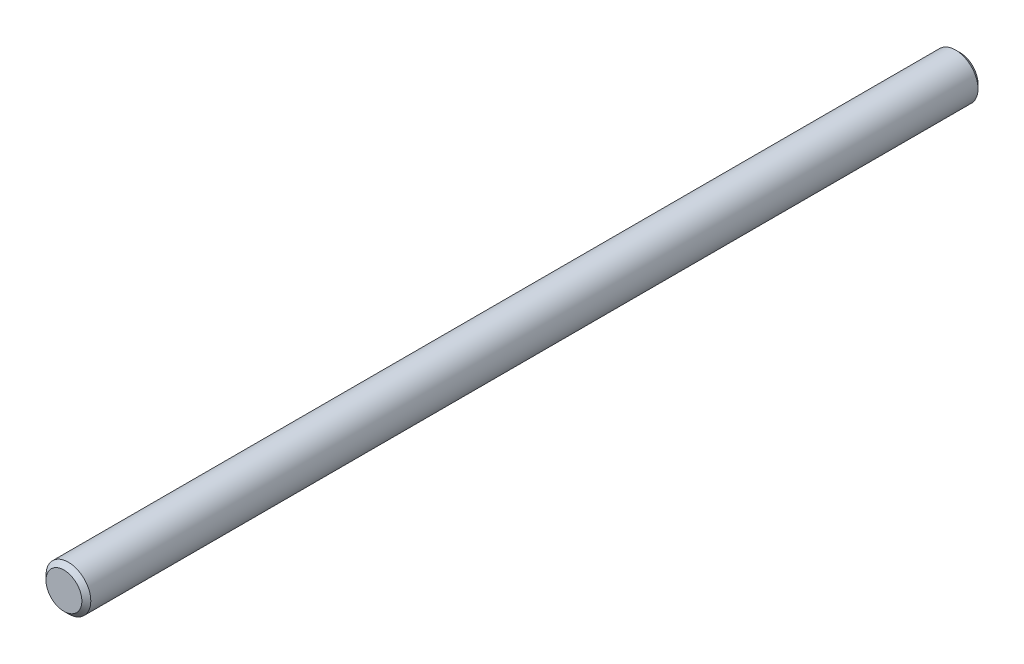
ISO-10303-21;
HEADER;
FILE_DESCRIPTION(('STEP AP214'),'2;1');
FILE_NAME('part.step','',(''),(''),'','','');
FILE_SCHEMA(('AUTOMOTIVE_DESIGN { 1 0 10303 214 1 1 1 1 }'));
ENDSEC;
DATA;
#1=APPLICATION_CONTEXT('core data for automotive mechanical design processes');
#2=APPLICATION_PROTOCOL_DEFINITION('international standard','automotive_design',2000,#1);
#3=PRODUCT_CONTEXT('',#1,'mechanical');
#4=PRODUCT('Part','Part','',(#3));
#5=PRODUCT_RELATED_PRODUCT_CATEGORY('part','',(#4));
#6=PRODUCT_DEFINITION_FORMATION('','',#4);
#7=PRODUCT_DEFINITION_CONTEXT('part definition',#1,'design');
#8=PRODUCT_DEFINITION('design','',#6,#7);
#9=PRODUCT_DEFINITION_SHAPE('','',#8);
#10=(LENGTH_UNIT() NAMED_UNIT(*) SI_UNIT(.MILLI.,.METRE.));
#11=(NAMED_UNIT(*) PLANE_ANGLE_UNIT() SI_UNIT($,.RADIAN.));
#12=(NAMED_UNIT(*) SI_UNIT($,.STERADIAN.) SOLID_ANGLE_UNIT());
#13=UNCERTAINTY_MEASURE_WITH_UNIT(LENGTH_MEASURE(1.E-05),#10,'distance_accuracy_value','');
#14=(GEOMETRIC_REPRESENTATION_CONTEXT(3) GLOBAL_UNCERTAINTY_ASSIGNED_CONTEXT((#13)) GLOBAL_UNIT_ASSIGNED_CONTEXT((#10,
#11,#12)) REPRESENTATION_CONTEXT('',''));
#15=CARTESIAN_POINT('',(0.,0.,0.));
#16=DIRECTION('',(0.,0.,1.));
#17=DIRECTION('',(1.,0.,0.));
#18=AXIS2_PLACEMENT_3D('',#15,#16,#17);
#19=CARTESIAN_POINT('',(0.,0.,100.));
#20=DIRECTION('',(0.,0.,-1.));
#21=DIRECTION('',(-1.,0.,0.));
#22=AXIS2_PLACEMENT_3D('',#19,#20,#21);
#23=CYLINDRICAL_SURFACE('',#22,5.);
#24=CARTESIAN_POINT('',(0.,0.,-99.0000000000001));
#25=DIRECTION('',(0.,0.,1.));
#26=DIRECTION('',(1.,0.,0.));
#27=AXIS2_PLACEMENT_3D('',#24,#25,#26);
#28=CIRCLE('',#27,5.);
#29=CARTESIAN_POINT('',(5.,0.,-99.0000000000001));
#30=VERTEX_POINT('',#29);
#31=EDGE_CURVE('E41',#30,#30,#28,.T.);
#32=ORIENTED_EDGE('',*,*,#31,.T.);
#33=EDGE_LOOP('',(#32));
#34=FACE_BOUND('',#33,.T.);
#35=CARTESIAN_POINT('',(0.,0.,99.));
#36=DIRECTION('',(0.,0.,1.));
#37=DIRECTION('',(1.,0.,0.));
#38=AXIS2_PLACEMENT_3D('',#35,#36,#37);
#39=CIRCLE('',#38,5.);
#40=CARTESIAN_POINT('',(5.,0.,99.));
#41=VERTEX_POINT('',#40);
#42=EDGE_CURVE('E45',#41,#41,#39,.F.);
#43=ORIENTED_EDGE('',*,*,#42,.T.);
#44=EDGE_LOOP('',(#43));
#45=FACE_BOUND('',#44,.T.);
#46=ADVANCED_FACE('F30',(#34,#45),#23,.T.);
#47=CARTESIAN_POINT('',(0.,0.,100.));
#48=DIRECTION('',(0.,0.,1.));
#49=DIRECTION('',(1.,0.,0.));
#50=AXIS2_PLACEMENT_3D('',#47,#48,#49);
#51=PLANE('',#50);
#52=CARTESIAN_POINT('',(0.,0.,100.));
#53=DIRECTION('',(0.,0.,1.));
#54=DIRECTION('',(1.,0.,0.));
#55=AXIS2_PLACEMENT_3D('',#52,#53,#54);
#56=CIRCLE('',#55,4.);
#57=CARTESIAN_POINT('',(4.,0.,100.));
#58=VERTEX_POINT('',#57);
#59=EDGE_CURVE('E10',#58,#58,#56,.T.);
#60=ORIENTED_EDGE('',*,*,#59,.T.);
#61=EDGE_LOOP('',(#60));
#62=FACE_BOUND('',#61,.T.);
#63=ADVANCED_FACE('F61',(#62),#51,.T.);
#64=CARTESIAN_POINT('',(0.,0.,-100.));
#65=DIRECTION('',(0.,0.,1.));
#66=DIRECTION('',(1.,0.,0.));
#67=AXIS2_PLACEMENT_3D('',#64,#65,#66);
#68=PLANE('',#67);
#69=CARTESIAN_POINT('',(0.,0.,-100.));
#70=DIRECTION('',(0.,0.,1.));
#71=DIRECTION('',(1.,0.,0.));
#72=AXIS2_PLACEMENT_3D('',#69,#70,#71);
#73=CIRCLE('',#72,4.00000000000003);
#74=CARTESIAN_POINT('',(4.00000000000003,0.,-100.));
#75=VERTEX_POINT('',#74);
#76=EDGE_CURVE('E37',#75,#75,#73,.F.);
#77=ORIENTED_EDGE('',*,*,#76,.T.);
#78=EDGE_LOOP('',(#77));
#79=FACE_BOUND('',#78,.T.);
#80=ADVANCED_FACE('F58',(#79),#68,.F.);
#81=CARTESIAN_POINT('',(0.,0.,-99.0000000000001));
#82=DIRECTION('',(0.,0.,1.));
#83=DIRECTION('',(1.,0.,0.));
#84=AXIS2_PLACEMENT_3D('',#81,#82,#83);
#85=CONICAL_SURFACE('',#84,5.,0.78539816339746);
#86=ORIENTED_EDGE('',*,*,#76,.F.);
#87=EDGE_LOOP('',(#86));
#88=FACE_BOUND('',#87,.T.);
#89=ORIENTED_EDGE('',*,*,#31,.F.);
#90=EDGE_LOOP('',(#89));
#91=FACE_BOUND('',#90,.T.);
#92=ADVANCED_FACE('F54',(#88,#91),#85,.T.);
#93=CARTESIAN_POINT('',(0.,0.,100.));
#94=DIRECTION('',(0.,0.,-1.));
#95=DIRECTION('',(-1.,0.,0.));
#96=AXIS2_PLACEMENT_3D('',#93,#94,#95);
#97=CONICAL_SURFACE('',#96,4.,0.785398163397439);
#98=ORIENTED_EDGE('',*,*,#42,.F.);
#99=EDGE_LOOP('',(#98));
#100=FACE_BOUND('',#99,.T.);
#101=ORIENTED_EDGE('',*,*,#59,.F.);
#102=EDGE_LOOP('',(#101));
#103=FACE_BOUND('',#102,.T.);
#104=ADVANCED_FACE('F32',(#100,#103),#97,.T.);
#105=CLOSED_SHELL('',(#46,#63,#80,#92,#104));
#106=MANIFOLD_SOLID_BREP('B2',#105);
#107=ADVANCED_BREP_SHAPE_REPRESENTATION('',(#18,#106),#14);
#108=SHAPE_DEFINITION_REPRESENTATION(#9,#107);
ENDSEC;
END-ISO-10303-21;
